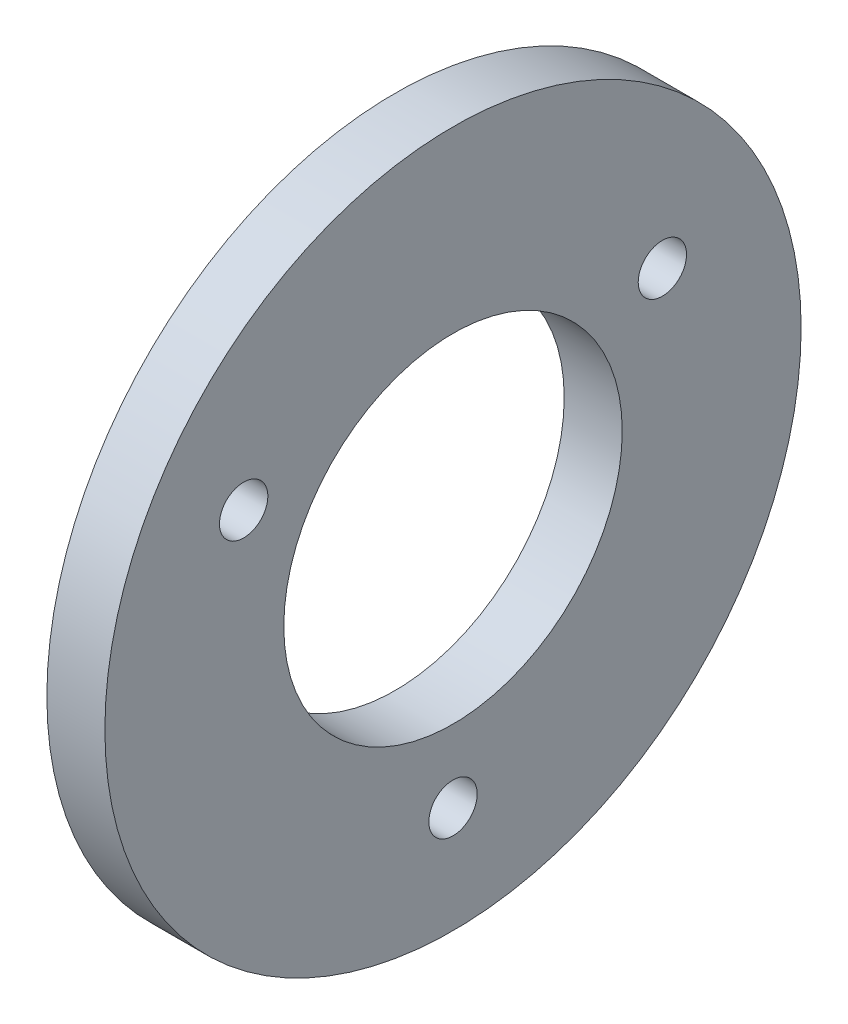
ISO-10303-21;
HEADER;
FILE_DESCRIPTION(('STEP AP214'),'2;1');
FILE_NAME('part.step','',(''),(''),'','','');
FILE_SCHEMA(('AUTOMOTIVE_DESIGN { 1 0 10303 214 1 1 1 1 }'));
ENDSEC;
DATA;
#1=APPLICATION_CONTEXT('core data for automotive mechanical design processes');
#2=APPLICATION_PROTOCOL_DEFINITION('international standard','automotive_design',2000,#1);
#3=PRODUCT_CONTEXT('',#1,'mechanical');
#4=PRODUCT('Part','Part','',(#3));
#5=PRODUCT_RELATED_PRODUCT_CATEGORY('part','',(#4));
#6=PRODUCT_DEFINITION_FORMATION('','',#4);
#7=PRODUCT_DEFINITION_CONTEXT('part definition',#1,'design');
#8=PRODUCT_DEFINITION('design','',#6,#7);
#9=PRODUCT_DEFINITION_SHAPE('','',#8);
#10=(LENGTH_UNIT() NAMED_UNIT(*) SI_UNIT(.MILLI.,.METRE.));
#11=(NAMED_UNIT(*) PLANE_ANGLE_UNIT() SI_UNIT($,.RADIAN.));
#12=(NAMED_UNIT(*) SI_UNIT($,.STERADIAN.) SOLID_ANGLE_UNIT());
#13=UNCERTAINTY_MEASURE_WITH_UNIT(LENGTH_MEASURE(1.E-05),#10,'distance_accuracy_value','');
#14=(GEOMETRIC_REPRESENTATION_CONTEXT(3) GLOBAL_UNCERTAINTY_ASSIGNED_CONTEXT((#13)) GLOBAL_UNIT_ASSIGNED_CONTEXT((#10,
#11,#12)) REPRESENTATION_CONTEXT('',''));
#15=CARTESIAN_POINT('',(0.,0.,0.));
#16=DIRECTION('',(0.,0.,1.));
#17=DIRECTION('',(1.,0.,0.));
#18=AXIS2_PLACEMENT_3D('',#15,#16,#17);
#19=CARTESIAN_POINT('',(-139.35,-155.807573628499,0.));
#20=DIRECTION('',(-1.,0.,0.));
#21=DIRECTION('',(0.,0.,1.));
#22=AXIS2_PLACEMENT_3D('',#19,#20,#21);
#23=PLANE('',#22);
#24=CARTESIAN_POINT('',(-139.35,-180.807573628499,0.));
#25=DIRECTION('',(-1.,0.,0.));
#26=DIRECTION('',(0.,0.,1.));
#27=AXIS2_PLACEMENT_3D('',#24,#25,#26);
#28=CIRCLE('',#27,2.5);
#29=CARTESIAN_POINT('',(-139.35,-180.807573628499,2.49999999999999));
#30=VERTEX_POINT('',#29);
#31=EDGE_CURVE('E60',#30,#30,#28,.T.);
#32=ORIENTED_EDGE('',*,*,#31,.F.);
#33=EDGE_LOOP('',(#32));
#34=FACE_BOUND('',#33,.T.);
#35=CARTESIAN_POINT('',(-139.35,-155.807573628499,0.));
#36=DIRECTION('',(-1.,0.,0.));
#37=DIRECTION('',(0.,0.,1.));
#38=AXIS2_PLACEMENT_3D('',#35,#36,#37);
#39=CIRCLE('',#38,17.5);
#40=CARTESIAN_POINT('',(-139.35,-155.807573628499,17.5));
#41=VERTEX_POINT('',#40);
#42=EDGE_CURVE('E49',#41,#41,#39,.T.);
#43=ORIENTED_EDGE('',*,*,#42,.F.);
#44=EDGE_LOOP('',(#43));
#45=FACE_BOUND('',#44,.T.);
#46=CARTESIAN_POINT('',(-139.35,-155.807573628499,0.));
#47=DIRECTION('',(-1.,0.,0.));
#48=DIRECTION('',(0.,0.,1.));
#49=AXIS2_PLACEMENT_3D('',#46,#47,#48);
#50=CIRCLE('',#49,36.);
#51=CARTESIAN_POINT('',(-139.35,-155.807573628499,36.));
#52=VERTEX_POINT('',#51);
#53=EDGE_CURVE('E10',#52,#52,#50,.T.);
#54=ORIENTED_EDGE('',*,*,#53,.T.);
#55=EDGE_LOOP('',(#54));
#56=FACE_BOUND('',#55,.T.);
#57=CARTESIAN_POINT('',(-139.35,-143.307573628499,-21.6506350946111));
#58=DIRECTION('',(-1.,0.,0.));
#59=DIRECTION('',(0.,0.,1.));
#60=AXIS2_PLACEMENT_3D('',#57,#58,#59);
#61=CIRCLE('',#60,2.5);
#62=CARTESIAN_POINT('',(-139.35,-143.307573628499,-19.1506350946111));
#63=VERTEX_POINT('',#62);
#64=EDGE_CURVE('E54',#63,#63,#61,.T.);
#65=ORIENTED_EDGE('',*,*,#64,.F.);
#66=EDGE_LOOP('',(#65));
#67=FACE_BOUND('',#66,.T.);
#68=CARTESIAN_POINT('',(-139.35,-143.307573628498,21.6506350946109));
#69=DIRECTION('',(-1.,0.,0.));
#70=DIRECTION('',(0.,0.,1.));
#71=AXIS2_PLACEMENT_3D('',#68,#69,#70);
#72=CIRCLE('',#71,2.5);
#73=CARTESIAN_POINT('',(-139.35,-143.307573628498,24.1506350946109));
#74=VERTEX_POINT('',#73);
#75=EDGE_CURVE('E66',#74,#74,#72,.T.);
#76=ORIENTED_EDGE('',*,*,#75,.F.);
#77=EDGE_LOOP('',(#76));
#78=FACE_BOUND('',#77,.T.);
#79=ADVANCED_FACE('F38',(#34,#45,#56,#67,#78),#23,.T.);
#80=CARTESIAN_POINT('',(-133.35,-155.807573628499,0.));
#81=DIRECTION('',(-1.,0.,0.));
#82=DIRECTION('',(0.,0.,1.));
#83=AXIS2_PLACEMENT_3D('',#80,#81,#82);
#84=PLANE('',#83);
#85=CARTESIAN_POINT('',(-133.35,-155.807573628499,0.));
#86=DIRECTION('',(-1.,0.,0.));
#87=DIRECTION('',(0.,0.,1.));
#88=AXIS2_PLACEMENT_3D('',#85,#86,#87);
#89=CIRCLE('',#88,36.);
#90=CARTESIAN_POINT('',(-133.35,-155.807573628499,36.));
#91=VERTEX_POINT('',#90);
#92=EDGE_CURVE('E42',#91,#91,#89,.T.);
#93=ORIENTED_EDGE('',*,*,#92,.F.);
#94=EDGE_LOOP('',(#93));
#95=FACE_BOUND('',#94,.T.);
#96=CARTESIAN_POINT('',(-133.35,-155.807573628499,0.));
#97=DIRECTION('',(-1.,0.,0.));
#98=DIRECTION('',(0.,0.,1.));
#99=AXIS2_PLACEMENT_3D('',#96,#97,#98);
#100=CIRCLE('',#99,17.5);
#101=CARTESIAN_POINT('',(-133.35,-155.807573628499,17.5));
#102=VERTEX_POINT('',#101);
#103=EDGE_CURVE('E51',#102,#102,#100,.T.);
#104=ORIENTED_EDGE('',*,*,#103,.T.);
#105=EDGE_LOOP('',(#104));
#106=FACE_BOUND('',#105,.T.);
#107=CARTESIAN_POINT('',(-133.35,-143.307573628499,-21.6506350946111));
#108=DIRECTION('',(-1.,0.,0.));
#109=DIRECTION('',(0.,0.,1.));
#110=AXIS2_PLACEMENT_3D('',#107,#108,#109);
#111=CIRCLE('',#110,2.5);
#112=CARTESIAN_POINT('',(-133.35,-143.307573628499,-19.1506350946111));
#113=VERTEX_POINT('',#112);
#114=EDGE_CURVE('E57',#113,#113,#111,.T.);
#115=ORIENTED_EDGE('',*,*,#114,.T.);
#116=EDGE_LOOP('',(#115));
#117=FACE_BOUND('',#116,.T.);
#118=CARTESIAN_POINT('',(-133.35,-180.807573628499,0.));
#119=DIRECTION('',(-1.,0.,0.));
#120=DIRECTION('',(0.,0.,1.));
#121=AXIS2_PLACEMENT_3D('',#118,#119,#120);
#122=CIRCLE('',#121,2.5);
#123=CARTESIAN_POINT('',(-133.35,-180.807573628499,2.49999999999999));
#124=VERTEX_POINT('',#123);
#125=EDGE_CURVE('E63',#124,#124,#122,.T.);
#126=ORIENTED_EDGE('',*,*,#125,.T.);
#127=EDGE_LOOP('',(#126));
#128=FACE_BOUND('',#127,.T.);
#129=CARTESIAN_POINT('',(-133.35,-143.307573628498,21.6506350946109));
#130=DIRECTION('',(-1.,0.,0.));
#131=DIRECTION('',(0.,0.,1.));
#132=AXIS2_PLACEMENT_3D('',#129,#130,#131);
#133=CIRCLE('',#132,2.5);
#134=CARTESIAN_POINT('',(-133.35,-143.307573628498,24.1506350946109));
#135=VERTEX_POINT('',#134);
#136=EDGE_CURVE('E69',#135,#135,#133,.T.);
#137=ORIENTED_EDGE('',*,*,#136,.T.);
#138=EDGE_LOOP('',(#137));
#139=FACE_BOUND('',#138,.T.);
#140=ADVANCED_FACE('F79',(#95,#106,#117,#128,#139),#84,.F.);
#141=CARTESIAN_POINT('',(-139.35,-155.807573628499,0.));
#142=DIRECTION('',(1.,0.,0.));
#143=DIRECTION('',(0.,0.,-1.));
#144=AXIS2_PLACEMENT_3D('',#141,#142,#143);
#145=CYLINDRICAL_SURFACE('',#144,36.);
#146=ORIENTED_EDGE('',*,*,#53,.F.);
#147=EDGE_LOOP('',(#146));
#148=FACE_BOUND('',#147,.T.);
#149=ORIENTED_EDGE('',*,*,#92,.T.);
#150=EDGE_LOOP('',(#149));
#151=FACE_BOUND('',#150,.T.);
#152=ADVANCED_FACE('F40',(#148,#151),#145,.T.);
#153=CARTESIAN_POINT('',(-139.35,-155.807573628499,0.));
#154=DIRECTION('',(1.,0.,0.));
#155=DIRECTION('',(0.,0.,-1.));
#156=AXIS2_PLACEMENT_3D('',#153,#154,#155);
#157=CYLINDRICAL_SURFACE('',#156,17.5);
#158=ORIENTED_EDGE('',*,*,#42,.T.);
#159=EDGE_LOOP('',(#158));
#160=FACE_BOUND('',#159,.T.);
#161=ORIENTED_EDGE('',*,*,#103,.F.);
#162=EDGE_LOOP('',(#161));
#163=FACE_BOUND('',#162,.T.);
#164=ADVANCED_FACE('F89',(#160,#163),#157,.F.);
#165=CARTESIAN_POINT('',(-139.35,-143.307573628499,-21.6506350946111));
#166=DIRECTION('',(1.,0.,0.));
#167=DIRECTION('',(0.,0.,-1.));
#168=AXIS2_PLACEMENT_3D('',#165,#166,#167);
#169=CYLINDRICAL_SURFACE('',#168,2.5);
#170=ORIENTED_EDGE('',*,*,#64,.T.);
#171=EDGE_LOOP('',(#170));
#172=FACE_BOUND('',#171,.T.);
#173=ORIENTED_EDGE('',*,*,#114,.F.);
#174=EDGE_LOOP('',(#173));
#175=FACE_BOUND('',#174,.T.);
#176=ADVANCED_FACE('F92',(#172,#175),#169,.F.);
#177=CARTESIAN_POINT('',(-139.35,-180.807573628499,0.));
#178=DIRECTION('',(1.,0.,0.));
#179=DIRECTION('',(0.,0.,-1.));
#180=AXIS2_PLACEMENT_3D('',#177,#178,#179);
#181=CYLINDRICAL_SURFACE('',#180,2.5);
#182=ORIENTED_EDGE('',*,*,#31,.T.);
#183=EDGE_LOOP('',(#182));
#184=FACE_BOUND('',#183,.T.);
#185=ORIENTED_EDGE('',*,*,#125,.F.);
#186=EDGE_LOOP('',(#185));
#187=FACE_BOUND('',#186,.T.);
#188=ADVANCED_FACE('F96',(#184,#187),#181,.F.);
#189=CARTESIAN_POINT('',(-139.35,-143.307573628498,21.6506350946109));
#190=DIRECTION('',(1.,0.,0.));
#191=DIRECTION('',(0.,0.,-1.));
#192=AXIS2_PLACEMENT_3D('',#189,#190,#191);
#193=CYLINDRICAL_SURFACE('',#192,2.5);
#194=ORIENTED_EDGE('',*,*,#75,.T.);
#195=EDGE_LOOP('',(#194));
#196=FACE_BOUND('',#195,.T.);
#197=ORIENTED_EDGE('',*,*,#136,.F.);
#198=EDGE_LOOP('',(#197));
#199=FACE_BOUND('',#198,.T.);
#200=ADVANCED_FACE('F75',(#196,#199),#193,.F.);
#201=CLOSED_SHELL('',(#79,#140,#152,#164,#176,#188,#200));
#202=MANIFOLD_SOLID_BREP('B2',#201);
#203=ADVANCED_BREP_SHAPE_REPRESENTATION('',(#18,#202),#14);
#204=SHAPE_DEFINITION_REPRESENTATION(#9,#203);
ENDSEC;
END-ISO-10303-21;
